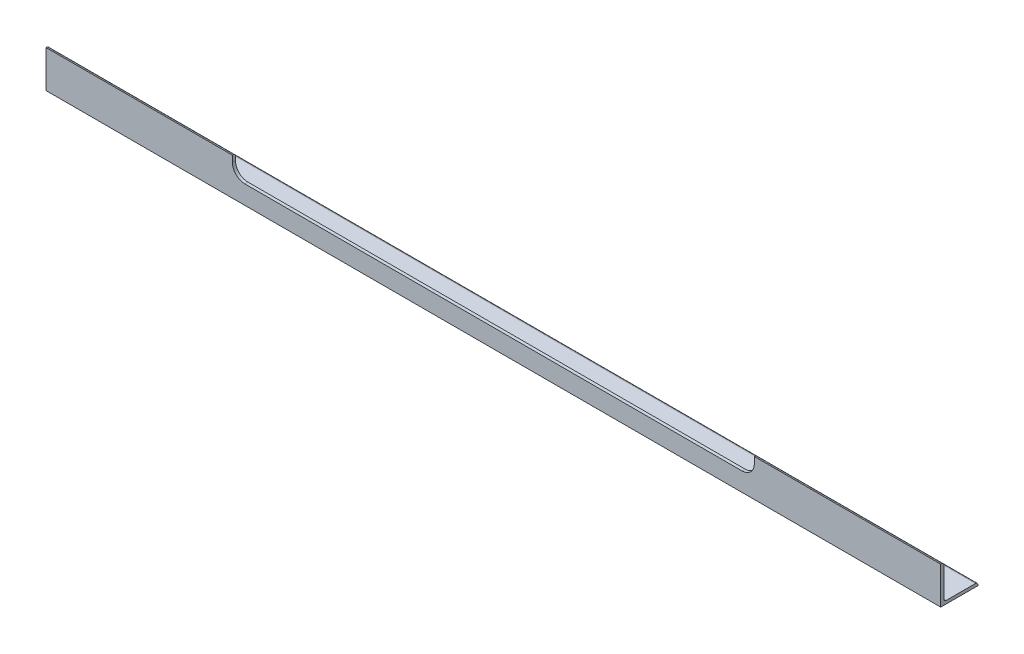
ISO-10303-21;
HEADER;
FILE_DESCRIPTION(('STEP AP214'),'2;1');
FILE_NAME('part.step','',(''),(''),'','','');
FILE_SCHEMA(('AUTOMOTIVE_DESIGN { 1 0 10303 214 1 1 1 1 }'));
ENDSEC;
DATA;
#1=APPLICATION_CONTEXT('core data for automotive mechanical design processes');
#2=APPLICATION_PROTOCOL_DEFINITION('international standard','automotive_design',2000,#1);
#3=PRODUCT_CONTEXT('',#1,'mechanical');
#4=PRODUCT('Part','Part','',(#3));
#5=PRODUCT_RELATED_PRODUCT_CATEGORY('part','',(#4));
#6=PRODUCT_DEFINITION_FORMATION('','',#4);
#7=PRODUCT_DEFINITION_CONTEXT('part definition',#1,'design');
#8=PRODUCT_DEFINITION('design','',#6,#7);
#9=PRODUCT_DEFINITION_SHAPE('','',#8);
#10=(LENGTH_UNIT() NAMED_UNIT(*) SI_UNIT(.MILLI.,.METRE.));
#11=(NAMED_UNIT(*) PLANE_ANGLE_UNIT() SI_UNIT($,.RADIAN.));
#12=(NAMED_UNIT(*) SI_UNIT($,.STERADIAN.) SOLID_ANGLE_UNIT());
#13=UNCERTAINTY_MEASURE_WITH_UNIT(LENGTH_MEASURE(1.E-05),#10,'distance_accuracy_value','');
#14=(GEOMETRIC_REPRESENTATION_CONTEXT(3) GLOBAL_UNCERTAINTY_ASSIGNED_CONTEXT((#13)) GLOBAL_UNIT_ASSIGNED_CONTEXT((#10,
#11,#12)) REPRESENTATION_CONTEXT('',''));
#15=CARTESIAN_POINT('',(0.,0.,0.));
#16=DIRECTION('',(0.,0.,1.));
#17=DIRECTION('',(1.,0.,0.));
#18=AXIS2_PLACEMENT_3D('',#15,#16,#17);
#19=CARTESIAN_POINT('',(-914.4,76.2,0.));
#20=DIRECTION('',(0.,1.,0.));
#21=DIRECTION('',(0.,0.,1.));
#22=AXIS2_PLACEMENT_3D('',#19,#20,#21);
#23=PLANE('',#22);
#24=DIRECTION('',(0.,0.,1.));
#25=VECTOR('',#24,1.);
#26=CARTESIAN_POINT('',(-533.4,76.2,-76.2));
#27=LINE('',#26,#25);
#28=CARTESIAN_POINT('',(-533.4,76.2,-1.27000000000002));
#29=VERTEX_POINT('',#28);
#30=CARTESIAN_POINT('',(-533.4,76.2,0.));
#31=VERTEX_POINT('',#30);
#32=EDGE_CURVE('E162',#29,#31,#27,.T.);
#33=ORIENTED_EDGE('',*,*,#32,.F.);
#34=DIRECTION('',(1.,0.,0.));
#35=VECTOR('',#34,1.);
#36=CARTESIAN_POINT('',(-914.4,76.2,-1.26999999999996));
#37=LINE('',#36,#35);
#38=CARTESIAN_POINT('',(-914.4,76.2,-1.26999999999996));
#39=VERTEX_POINT('',#38);
#40=EDGE_CURVE('E181',#39,#29,#37,.T.);
#41=ORIENTED_EDGE('',*,*,#40,.F.);
#42=DIRECTION('',(0.,0.,1.));
#43=VECTOR('',#42,1.);
#44=CARTESIAN_POINT('',(-914.4,76.2,0.));
#45=LINE('',#44,#43);
#46=CARTESIAN_POINT('',(-914.4,76.2,0.));
#47=VERTEX_POINT('',#46);
#48=EDGE_CURVE('E243',#39,#47,#45,.T.);
#49=ORIENTED_EDGE('',*,*,#48,.T.);
#50=DIRECTION('',(1.,0.,0.));
#51=VECTOR('',#50,1.);
#52=CARTESIAN_POINT('',(-914.4,76.2,0.));
#53=LINE('',#52,#51);
#54=EDGE_CURVE('E168',#47,#31,#53,.T.);
#55=ORIENTED_EDGE('',*,*,#54,.T.);
#56=EDGE_LOOP('',(#33,#41,#49,#55));
#57=FACE_BOUND('',#56,.T.);
#58=ADVANCED_FACE('F32',(#57),#23,.T.);
#59=CARTESIAN_POINT('',(-914.4,71.12,-1.27));
#60=DIRECTION('',(1.,0.,0.));
#61=DIRECTION('',(0.,0.,-1.));
#62=AXIS2_PLACEMENT_3D('',#59,#60,#61);
#63=CYLINDRICAL_SURFACE('',#62,5.08);
#64=CARTESIAN_POINT('',(-533.4,71.12,-1.27));
#65=DIRECTION('',(-1.,0.,0.));
#66=DIRECTION('',(0.,0.,1.));
#67=AXIS2_PLACEMENT_3D('',#64,#65,#66);
#68=CIRCLE('',#67,5.08);
#69=CARTESIAN_POINT('',(-533.4,71.12,-6.35));
#70=VERTEX_POINT('',#69);
#71=EDGE_CURVE('E217',#70,#29,#68,.F.);
#72=ORIENTED_EDGE('',*,*,#71,.F.);
#73=DIRECTION('',(1.,0.,0.));
#74=VECTOR('',#73,1.);
#75=CARTESIAN_POINT('',(-914.4,71.12,-6.35));
#76=LINE('',#75,#74);
#77=CARTESIAN_POINT('',(-914.4,71.12,-6.35));
#78=VERTEX_POINT('',#77);
#79=EDGE_CURVE('E268',#78,#70,#76,.T.);
#80=ORIENTED_EDGE('',*,*,#79,.F.);
#81=CARTESIAN_POINT('',(-914.4,71.12,-1.27));
#82=DIRECTION('',(1.,0.,0.));
#83=DIRECTION('',(0.,0.,-1.));
#84=AXIS2_PLACEMENT_3D('',#81,#82,#83);
#85=CIRCLE('',#84,5.08);
#86=EDGE_CURVE('E169',#78,#39,#85,.T.);
#87=ORIENTED_EDGE('',*,*,#86,.T.);
#88=ORIENTED_EDGE('',*,*,#40,.T.);
#89=EDGE_LOOP('',(#72,#80,#87,#88));
#90=FACE_BOUND('',#89,.T.);
#91=ADVANCED_FACE('F301',(#90),#63,.T.);
#92=DIRECTION('',(0.,0.,1.));
#93=VECTOR('',#92,1.);
#94=CARTESIAN_POINT('',(533.4,76.2,-76.2));
#95=LINE('',#94,#93);
#96=CARTESIAN_POINT('',(533.4,76.2,-1.27));
#97=VERTEX_POINT('',#96);
#98=CARTESIAN_POINT('',(533.4,76.2,0.));
#99=VERTEX_POINT('',#98);
#100=EDGE_CURVE('E148',#97,#99,#95,.T.);
#101=ORIENTED_EDGE('',*,*,#100,.T.);
#102=CARTESIAN_POINT('',(914.4,76.2,0.));
#103=VERTEX_POINT('',#102);
#104=EDGE_CURVE('E159',#99,#103,#53,.T.);
#105=ORIENTED_EDGE('',*,*,#104,.T.);
#106=DIRECTION('',(0.,0.,1.));
#107=VECTOR('',#106,1.);
#108=CARTESIAN_POINT('',(914.4,76.2,0.));
#109=LINE('',#108,#107);
#110=CARTESIAN_POINT('',(914.4,76.2,-1.26999999999996));
#111=VERTEX_POINT('',#110);
#112=EDGE_CURVE('E219',#111,#103,#109,.T.);
#113=ORIENTED_EDGE('',*,*,#112,.F.);
#114=EDGE_CURVE('E161',#97,#111,#37,.T.);
#115=ORIENTED_EDGE('',*,*,#114,.F.);
#116=EDGE_LOOP('',(#101,#105,#113,#115));
#117=FACE_BOUND('',#116,.T.);
#118=ADVANCED_FACE('F157',(#117),#23,.T.);
#119=CARTESIAN_POINT('',(533.4,71.12,-1.27));
#120=DIRECTION('',(1.,0.,0.));
#121=DIRECTION('',(0.,0.,-1.));
#122=AXIS2_PLACEMENT_3D('',#119,#120,#121);
#123=CIRCLE('',#122,5.08);
#124=CARTESIAN_POINT('',(533.4,71.12,-6.35));
#125=VERTEX_POINT('',#124);
#126=EDGE_CURVE('E201',#97,#125,#123,.F.);
#127=ORIENTED_EDGE('',*,*,#126,.F.);
#128=ORIENTED_EDGE('',*,*,#114,.T.);
#129=CARTESIAN_POINT('',(914.4,71.12,-1.27));
#130=DIRECTION('',(1.,0.,0.));
#131=DIRECTION('',(0.,0.,-1.));
#132=AXIS2_PLACEMENT_3D('',#129,#130,#131);
#133=CIRCLE('',#132,5.08);
#134=CARTESIAN_POINT('',(914.4,71.12,-6.35));
#135=VERTEX_POINT('',#134);
#136=EDGE_CURVE('E240',#135,#111,#133,.T.);
#137=ORIENTED_EDGE('',*,*,#136,.F.);
#138=EDGE_CURVE('E271',#125,#135,#76,.T.);
#139=ORIENTED_EDGE('',*,*,#138,.F.);
#140=EDGE_LOOP('',(#127,#128,#137,#139));
#141=FACE_BOUND('',#140,.T.);
#142=ADVANCED_FACE('F309',(#141),#63,.T.);
#143=CARTESIAN_POINT('',(-914.4,71.12,-6.35));
#144=DIRECTION('',(0.,0.,-1.));
#145=DIRECTION('',(-1.,0.,0.));
#146=AXIS2_PLACEMENT_3D('',#143,#144,#145);
#147=PLANE('',#146);
#148=DIRECTION('',(0.,1.,0.));
#149=VECTOR('',#148,1.);
#150=CARTESIAN_POINT('',(-533.4,71.12,-6.35));
#151=LINE('',#150,#149);
#152=CARTESIAN_POINT('',(-533.4,63.5,-6.35));
#153=VERTEX_POINT('',#152);
#154=EDGE_CURVE('E215',#153,#70,#151,.T.);
#155=ORIENTED_EDGE('',*,*,#154,.F.);
#156=CARTESIAN_POINT('',(-508.,63.5,-6.34999999999999));
#157=DIRECTION('',(0.,0.,-1.));
#158=DIRECTION('',(-1.,0.,0.));
#159=AXIS2_PLACEMENT_3D('',#156,#157,#158);
#160=CIRCLE('',#159,25.4);
#161=CARTESIAN_POINT('',(-508.,38.1,-6.35));
#162=VERTEX_POINT('',#161);
#163=EDGE_CURVE('E11',#153,#162,#160,.F.);
#164=ORIENTED_EDGE('',*,*,#163,.T.);
#165=DIRECTION('',(-1.,0.,0.));
#166=VECTOR('',#165,1.);
#167=CARTESIAN_POINT('',(-914.4,38.1,-6.35));
#168=LINE('',#167,#166);
#169=CARTESIAN_POINT('',(508.,38.1,-6.35));
#170=VERTEX_POINT('',#169);
#171=EDGE_CURVE('E198',#170,#162,#168,.T.);
#172=ORIENTED_EDGE('',*,*,#171,.F.);
#173=CARTESIAN_POINT('',(508.,63.5,-6.34999999999999));
#174=DIRECTION('',(0.,0.,-1.));
#175=DIRECTION('',(-1.,0.,0.));
#176=AXIS2_PLACEMENT_3D('',#173,#174,#175);
#177=CIRCLE('',#176,25.4);
#178=CARTESIAN_POINT('',(533.4,63.5,-6.35));
#179=VERTEX_POINT('',#178);
#180=EDGE_CURVE('E189',#170,#179,#177,.F.);
#181=ORIENTED_EDGE('',*,*,#180,.T.);
#182=DIRECTION('',(0.,-1.,0.));
#183=VECTOR('',#182,1.);
#184=CARTESIAN_POINT('',(533.4,71.12,-6.35));
#185=LINE('',#184,#183);
#186=EDGE_CURVE('E195',#125,#179,#185,.T.);
#187=ORIENTED_EDGE('',*,*,#186,.F.);
#188=ORIENTED_EDGE('',*,*,#138,.T.);
#189=DIRECTION('',(0.,1.,0.));
#190=VECTOR('',#189,1.);
#191=CARTESIAN_POINT('',(914.4,71.12,-6.35));
#192=LINE('',#191,#190);
#193=CARTESIAN_POINT('',(914.4,11.43,-6.35));
#194=VERTEX_POINT('',#193);
#195=EDGE_CURVE('E237',#194,#135,#192,.T.);
#196=ORIENTED_EDGE('',*,*,#195,.F.);
#197=DIRECTION('',(1.,0.,0.));
#198=VECTOR('',#197,1.);
#199=CARTESIAN_POINT('',(-914.4,11.43,-6.35));
#200=LINE('',#199,#198);
#201=CARTESIAN_POINT('',(-914.4,11.43,-6.35));
#202=VERTEX_POINT('',#201);
#203=EDGE_CURVE('E272',#202,#194,#200,.T.);
#204=ORIENTED_EDGE('',*,*,#203,.F.);
#205=DIRECTION('',(0.,1.,0.));
#206=VECTOR('',#205,1.);
#207=CARTESIAN_POINT('',(-914.4,71.12,-6.35));
#208=LINE('',#207,#206);
#209=EDGE_CURVE('E174',#202,#78,#208,.T.);
#210=ORIENTED_EDGE('',*,*,#209,.T.);
#211=ORIENTED_EDGE('',*,*,#79,.T.);
#212=EDGE_LOOP('',(#155,#164,#172,#181,#187,#188,#196,#204,#210,#211));
#213=FACE_BOUND('',#212,.T.);
#214=ADVANCED_FACE('F194',(#213),#147,.T.);
#215=CARTESIAN_POINT('',(-914.4,11.43,-11.43));
#216=DIRECTION('',(1.,0.,0.));
#217=DIRECTION('',(0.,0.,-1.));
#218=AXIS2_PLACEMENT_3D('',#215,#216,#217);
#219=CYLINDRICAL_SURFACE('',#218,5.08);
#220=ORIENTED_EDGE('',*,*,#203,.T.);
#221=CARTESIAN_POINT('',(914.4,11.43,-11.43));
#222=DIRECTION('',(-1.,0.,0.));
#223=DIRECTION('',(0.,0.,-1.));
#224=AXIS2_PLACEMENT_3D('',#221,#222,#223);
#225=CIRCLE('',#224,5.08);
#226=CARTESIAN_POINT('',(914.4,6.35,-11.43));
#227=VERTEX_POINT('',#226);
#228=EDGE_CURVE('E234',#227,#194,#225,.T.);
#229=ORIENTED_EDGE('',*,*,#228,.F.);
#230=DIRECTION('',(1.,0.,0.));
#231=VECTOR('',#230,1.);
#232=CARTESIAN_POINT('',(-914.4,6.35,-11.43));
#233=LINE('',#232,#231);
#234=CARTESIAN_POINT('',(-914.4,6.35,-11.43));
#235=VERTEX_POINT('',#234);
#236=EDGE_CURVE('E274',#235,#227,#233,.T.);
#237=ORIENTED_EDGE('',*,*,#236,.F.);
#238=CARTESIAN_POINT('',(-914.4,11.43,-11.43));
#239=DIRECTION('',(-1.,0.,0.));
#240=DIRECTION('',(0.,0.,-1.));
#241=AXIS2_PLACEMENT_3D('',#238,#239,#240);
#242=CIRCLE('',#241,5.08);
#243=EDGE_CURVE('E261',#235,#202,#242,.T.);
#244=ORIENTED_EDGE('',*,*,#243,.T.);
#245=EDGE_LOOP('',(#220,#229,#237,#244));
#246=FACE_BOUND('',#245,.T.);
#247=ADVANCED_FACE('F319',(#246),#219,.F.);
#248=CARTESIAN_POINT('',(-914.4,6.35,-11.43));
#249=DIRECTION('',(0.,1.,0.));
#250=DIRECTION('',(0.,0.,1.));
#251=AXIS2_PLACEMENT_3D('',#248,#249,#250);
#252=PLANE('',#251);
#253=ORIENTED_EDGE('',*,*,#236,.T.);
#254=DIRECTION('',(0.,0.,1.));
#255=VECTOR('',#254,1.);
#256=CARTESIAN_POINT('',(914.4,6.35,-11.43));
#257=LINE('',#256,#255);
#258=CARTESIAN_POINT('',(914.4,6.35,-71.12));
#259=VERTEX_POINT('',#258);
#260=EDGE_CURVE('E231',#259,#227,#257,.T.);
#261=ORIENTED_EDGE('',*,*,#260,.F.);
#262=DIRECTION('',(1.,0.,0.));
#263=VECTOR('',#262,1.);
#264=CARTESIAN_POINT('',(-914.4,6.35,-71.12));
#265=LINE('',#264,#263);
#266=CARTESIAN_POINT('',(-914.4,6.35,-71.12));
#267=VERTEX_POINT('',#266);
#268=EDGE_CURVE('E276',#267,#259,#265,.T.);
#269=ORIENTED_EDGE('',*,*,#268,.F.);
#270=DIRECTION('',(0.,0.,1.));
#271=VECTOR('',#270,1.);
#272=CARTESIAN_POINT('',(-914.4,6.35,-11.43));
#273=LINE('',#272,#271);
#274=EDGE_CURVE('E258',#267,#235,#273,.T.);
#275=ORIENTED_EDGE('',*,*,#274,.T.);
#276=EDGE_LOOP('',(#253,#261,#269,#275));
#277=FACE_BOUND('',#276,.T.);
#278=ADVANCED_FACE('F326',(#277),#252,.T.);
#279=CARTESIAN_POINT('',(-914.4,1.27,-71.12));
#280=DIRECTION('',(1.,0.,0.));
#281=DIRECTION('',(0.,0.,-1.));
#282=AXIS2_PLACEMENT_3D('',#279,#280,#281);
#283=CYLINDRICAL_SURFACE('',#282,5.08);
#284=ORIENTED_EDGE('',*,*,#268,.T.);
#285=CARTESIAN_POINT('',(914.4,1.27,-71.12));
#286=DIRECTION('',(1.,0.,0.));
#287=DIRECTION('',(0.,0.,1.));
#288=AXIS2_PLACEMENT_3D('',#285,#286,#287);
#289=CIRCLE('',#288,5.08);
#290=CARTESIAN_POINT('',(914.4,1.26999999999996,-76.2));
#291=VERTEX_POINT('',#290);
#292=EDGE_CURVE('E228',#291,#259,#289,.T.);
#293=ORIENTED_EDGE('',*,*,#292,.F.);
#294=DIRECTION('',(1.,0.,0.));
#295=VECTOR('',#294,1.);
#296=CARTESIAN_POINT('',(-914.4,1.26999999999996,-76.2));
#297=LINE('',#296,#295);
#298=CARTESIAN_POINT('',(-914.4,1.26999999999996,-76.2));
#299=VERTEX_POINT('',#298);
#300=EDGE_CURVE('E278',#299,#291,#297,.T.);
#301=ORIENTED_EDGE('',*,*,#300,.F.);
#302=CARTESIAN_POINT('',(-914.4,1.27,-71.12));
#303=DIRECTION('',(1.,0.,0.));
#304=DIRECTION('',(0.,0.,1.));
#305=AXIS2_PLACEMENT_3D('',#302,#303,#304);
#306=CIRCLE('',#305,5.08);
#307=EDGE_CURVE('E255',#299,#267,#306,.T.);
#308=ORIENTED_EDGE('',*,*,#307,.T.);
#309=EDGE_LOOP('',(#284,#293,#301,#308));
#310=FACE_BOUND('',#309,.T.);
#311=ADVANCED_FACE('F297',(#310),#283,.T.);
#312=CARTESIAN_POINT('',(-914.4,1.26999999999996,-76.2));
#313=DIRECTION('',(0.,0.,-1.));
#314=DIRECTION('',(-1.,0.,0.));
#315=AXIS2_PLACEMENT_3D('',#312,#313,#314);
#316=PLANE('',#315);
#317=ORIENTED_EDGE('',*,*,#300,.T.);
#318=DIRECTION('',(0.,1.,0.));
#319=VECTOR('',#318,1.);
#320=CARTESIAN_POINT('',(914.4,1.26999999999996,-76.2));
#321=LINE('',#320,#319);
#322=CARTESIAN_POINT('',(914.4,0.,-76.2));
#323=VERTEX_POINT('',#322);
#324=EDGE_CURVE('E225',#323,#291,#321,.T.);
#325=ORIENTED_EDGE('',*,*,#324,.F.);
#326=DIRECTION('',(1.,0.,0.));
#327=VECTOR('',#326,1.);
#328=CARTESIAN_POINT('',(-914.4,0.,-76.2));
#329=LINE('',#328,#327);
#330=CARTESIAN_POINT('',(-914.4,0.,-76.2));
#331=VERTEX_POINT('',#330);
#332=EDGE_CURVE('E279',#331,#323,#329,.T.);
#333=ORIENTED_EDGE('',*,*,#332,.F.);
#334=DIRECTION('',(0.,1.,0.));
#335=VECTOR('',#334,1.);
#336=CARTESIAN_POINT('',(-914.4,1.26999999999996,-76.2));
#337=LINE('',#336,#335);
#338=EDGE_CURVE('E252',#331,#299,#337,.T.);
#339=ORIENTED_EDGE('',*,*,#338,.T.);
#340=EDGE_LOOP('',(#317,#325,#333,#339));
#341=FACE_BOUND('',#340,.T.);
#342=ADVANCED_FACE('F289',(#341),#316,.T.);
#343=CARTESIAN_POINT('',(-914.4,0.,0.));
#344=DIRECTION('',(0.,-1.,0.));
#345=DIRECTION('',(0.,0.,-1.));
#346=AXIS2_PLACEMENT_3D('',#343,#344,#345);
#347=PLANE('',#346);
#348=ORIENTED_EDGE('',*,*,#332,.T.);
#349=DIRECTION('',(0.,0.,-1.));
#350=VECTOR('',#349,1.);
#351=CARTESIAN_POINT('',(914.4,0.,0.));
#352=LINE('',#351,#350);
#353=CARTESIAN_POINT('',(914.4,0.,0.));
#354=VERTEX_POINT('',#353);
#355=EDGE_CURVE('E222',#354,#323,#352,.T.);
#356=ORIENTED_EDGE('',*,*,#355,.F.);
#357=DIRECTION('',(1.,0.,0.));
#358=VECTOR('',#357,1.);
#359=CARTESIAN_POINT('',(-914.4,0.,0.));
#360=LINE('',#359,#358);
#361=CARTESIAN_POINT('',(-914.4,0.,0.));
#362=VERTEX_POINT('',#361);
#363=EDGE_CURVE('E172',#362,#354,#360,.T.);
#364=ORIENTED_EDGE('',*,*,#363,.F.);
#365=DIRECTION('',(0.,0.,-1.));
#366=VECTOR('',#365,1.);
#367=CARTESIAN_POINT('',(-914.4,0.,0.));
#368=LINE('',#367,#366);
#369=EDGE_CURVE('E249',#362,#331,#368,.T.);
#370=ORIENTED_EDGE('',*,*,#369,.T.);
#371=EDGE_LOOP('',(#348,#356,#364,#370));
#372=FACE_BOUND('',#371,.T.);
#373=ADVANCED_FACE('F287',(#372),#347,.T.);
#374=CARTESIAN_POINT('',(-914.4,76.2,0.));
#375=DIRECTION('',(0.,0.,1.));
#376=DIRECTION('',(1.,0.,0.));
#377=AXIS2_PLACEMENT_3D('',#374,#375,#376);
#378=PLANE('',#377);
#379=DIRECTION('',(0.,-1.,0.));
#380=VECTOR('',#379,1.);
#381=CARTESIAN_POINT('',(-533.4,76.2,0.));
#382=LINE('',#381,#380);
#383=CARTESIAN_POINT('',(-533.4,63.5,0.));
#384=VERTEX_POINT('',#383);
#385=EDGE_CURVE('E208',#31,#384,#382,.T.);
#386=ORIENTED_EDGE('',*,*,#385,.F.);
#387=ORIENTED_EDGE('',*,*,#54,.F.);
#388=DIRECTION('',(0.,-1.,0.));
#389=VECTOR('',#388,1.);
#390=CARTESIAN_POINT('',(-914.4,76.2,0.));
#391=LINE('',#390,#389);
#392=EDGE_CURVE('E246',#47,#362,#391,.T.);
#393=ORIENTED_EDGE('',*,*,#392,.T.);
#394=ORIENTED_EDGE('',*,*,#363,.T.);
#395=DIRECTION('',(0.,-1.,0.));
#396=VECTOR('',#395,1.);
#397=CARTESIAN_POINT('',(914.4,76.2,0.));
#398=LINE('',#397,#396);
#399=EDGE_CURVE('E166',#103,#354,#398,.T.);
#400=ORIENTED_EDGE('',*,*,#399,.F.);
#401=ORIENTED_EDGE('',*,*,#104,.F.);
#402=DIRECTION('',(0.,1.,0.));
#403=VECTOR('',#402,1.);
#404=CARTESIAN_POINT('',(533.4,76.2,0.));
#405=LINE('',#404,#403);
#406=CARTESIAN_POINT('',(533.4,63.5,0.));
#407=VERTEX_POINT('',#406);
#408=EDGE_CURVE('E144',#407,#99,#405,.T.);
#409=ORIENTED_EDGE('',*,*,#408,.F.);
#410=CARTESIAN_POINT('',(508.,63.5,0.));
#411=DIRECTION('',(0.,0.,1.));
#412=DIRECTION('',(1.,0.,0.));
#413=AXIS2_PLACEMENT_3D('',#410,#411,#412);
#414=CIRCLE('',#413,25.4);
#415=CARTESIAN_POINT('',(508.,38.1,0.));
#416=VERTEX_POINT('',#415);
#417=EDGE_CURVE('E187',#407,#416,#414,.F.);
#418=ORIENTED_EDGE('',*,*,#417,.T.);
#419=DIRECTION('',(1.,0.,0.));
#420=VECTOR('',#419,1.);
#421=CARTESIAN_POINT('',(-533.4,38.1,0.));
#422=LINE('',#421,#420);
#423=CARTESIAN_POINT('',(-508.,38.1,0.));
#424=VERTEX_POINT('',#423);
#425=EDGE_CURVE('E153',#424,#416,#422,.T.);
#426=ORIENTED_EDGE('',*,*,#425,.F.);
#427=CARTESIAN_POINT('',(-508.,63.5,0.));
#428=DIRECTION('',(0.,0.,1.));
#429=DIRECTION('',(1.,0.,0.));
#430=AXIS2_PLACEMENT_3D('',#427,#428,#429);
#431=CIRCLE('',#430,25.4);
#432=EDGE_CURVE('E40',#424,#384,#431,.F.);
#433=ORIENTED_EDGE('',*,*,#432,.T.);
#434=EDGE_LOOP('',(#386,#387,#393,#394,#400,#401,#409,#418,#426,#433));
#435=FACE_BOUND('',#434,.T.);
#436=ADVANCED_FACE('F164',(#435),#378,.T.);
#437=CARTESIAN_POINT('',(-914.4,71.12,-1.27));
#438=DIRECTION('',(1.,0.,0.));
#439=DIRECTION('',(0.,0.,-1.));
#440=AXIS2_PLACEMENT_3D('',#437,#438,#439);
#441=PLANE('',#440);
#442=ORIENTED_EDGE('',*,*,#48,.F.);
#443=ORIENTED_EDGE('',*,*,#86,.F.);
#444=ORIENTED_EDGE('',*,*,#209,.F.);
#445=ORIENTED_EDGE('',*,*,#243,.F.);
#446=ORIENTED_EDGE('',*,*,#274,.F.);
#447=ORIENTED_EDGE('',*,*,#307,.F.);
#448=ORIENTED_EDGE('',*,*,#338,.F.);
#449=ORIENTED_EDGE('',*,*,#369,.F.);
#450=ORIENTED_EDGE('',*,*,#392,.F.);
#451=EDGE_LOOP('',(#442,#443,#444,#445,#446,#447,#448,#449,#450));
#452=FACE_BOUND('',#451,.T.);
#453=ADVANCED_FACE('F295',(#452),#441,.F.);
#454=CARTESIAN_POINT('',(914.4,71.12,-1.27));
#455=DIRECTION('',(1.,0.,0.));
#456=DIRECTION('',(0.,0.,-1.));
#457=AXIS2_PLACEMENT_3D('',#454,#455,#456);
#458=PLANE('',#457);
#459=ORIENTED_EDGE('',*,*,#112,.T.);
#460=ORIENTED_EDGE('',*,*,#399,.T.);
#461=ORIENTED_EDGE('',*,*,#355,.T.);
#462=ORIENTED_EDGE('',*,*,#324,.T.);
#463=ORIENTED_EDGE('',*,*,#292,.T.);
#464=ORIENTED_EDGE('',*,*,#260,.T.);
#465=ORIENTED_EDGE('',*,*,#228,.T.);
#466=ORIENTED_EDGE('',*,*,#195,.T.);
#467=ORIENTED_EDGE('',*,*,#136,.T.);
#468=EDGE_LOOP('',(#459,#460,#461,#462,#463,#464,#465,#466,#467));
#469=FACE_BOUND('',#468,.T.);
#470=ADVANCED_FACE('F285',(#469),#458,.T.);
#471=CARTESIAN_POINT('',(-533.4,76.2,-76.2));
#472=DIRECTION('',(-1.,0.,0.));
#473=DIRECTION('',(0.,0.,1.));
#474=AXIS2_PLACEMENT_3D('',#471,#472,#473);
#475=PLANE('',#474);
#476=ORIENTED_EDGE('',*,*,#385,.T.);
#477=DIRECTION('',(0.,0.,1.));
#478=VECTOR('',#477,1.);
#479=CARTESIAN_POINT('',(-533.4,63.5,-6.35000000000002));
#480=LINE('',#479,#478);
#481=EDGE_CURVE('E47',#384,#153,#480,.F.);
#482=ORIENTED_EDGE('',*,*,#481,.T.);
#483=ORIENTED_EDGE('',*,*,#154,.T.);
#484=ORIENTED_EDGE('',*,*,#71,.T.);
#485=ORIENTED_EDGE('',*,*,#32,.T.);
#486=EDGE_LOOP('',(#476,#482,#483,#484,#485));
#487=FACE_BOUND('',#486,.T.);
#488=ADVANCED_FACE('F349',(#487),#475,.F.);
#489=CARTESIAN_POINT('',(533.4,76.2,-76.2));
#490=DIRECTION('',(1.,0.,0.));
#491=DIRECTION('',(0.,0.,-1.));
#492=AXIS2_PLACEMENT_3D('',#489,#490,#491);
#493=PLANE('',#492);
#494=ORIENTED_EDGE('',*,*,#186,.T.);
#495=DIRECTION('',(0.,0.,1.));
#496=VECTOR('',#495,1.);
#497=CARTESIAN_POINT('',(533.4,63.5,0.));
#498=LINE('',#497,#496);
#499=EDGE_CURVE('E151',#179,#407,#498,.T.);
#500=ORIENTED_EDGE('',*,*,#499,.T.);
#501=ORIENTED_EDGE('',*,*,#408,.T.);
#502=ORIENTED_EDGE('',*,*,#100,.F.);
#503=ORIENTED_EDGE('',*,*,#126,.T.);
#504=EDGE_LOOP('',(#494,#500,#501,#502,#503));
#505=FACE_BOUND('',#504,.T.);
#506=ADVANCED_FACE('F147',(#505),#493,.F.);
#507=CARTESIAN_POINT('',(-533.4,38.1,-76.2));
#508=DIRECTION('',(0.,-1.,0.));
#509=DIRECTION('',(0.,0.,-1.));
#510=AXIS2_PLACEMENT_3D('',#507,#508,#509);
#511=PLANE('',#510);
#512=ORIENTED_EDGE('',*,*,#425,.T.);
#513=DIRECTION('',(0.,0.,1.));
#514=VECTOR('',#513,1.);
#515=CARTESIAN_POINT('',(508.,38.1,-6.35000000000002));
#516=LINE('',#515,#514);
#517=EDGE_CURVE('E184',#416,#170,#516,.F.);
#518=ORIENTED_EDGE('',*,*,#517,.T.);
#519=ORIENTED_EDGE('',*,*,#171,.T.);
#520=DIRECTION('',(0.,0.,1.));
#521=VECTOR('',#520,1.);
#522=CARTESIAN_POINT('',(-508.,38.1,0.));
#523=LINE('',#522,#521);
#524=EDGE_CURVE('E180',#162,#424,#523,.T.);
#525=ORIENTED_EDGE('',*,*,#524,.T.);
#526=EDGE_LOOP('',(#512,#518,#519,#525));
#527=FACE_BOUND('',#526,.T.);
#528=ADVANCED_FACE('F206',(#527),#511,.F.);
#529=CARTESIAN_POINT('',(508.,63.5,-76.2));
#530=DIRECTION('',(0.,0.,-1.));
#531=DIRECTION('',(-1.,0.,0.));
#532=AXIS2_PLACEMENT_3D('',#529,#530,#531);
#533=CYLINDRICAL_SURFACE('',#532,25.4);
#534=ORIENTED_EDGE('',*,*,#180,.F.);
#535=ORIENTED_EDGE('',*,*,#517,.F.);
#536=ORIENTED_EDGE('',*,*,#417,.F.);
#537=ORIENTED_EDGE('',*,*,#499,.F.);
#538=EDGE_LOOP('',(#534,#535,#536,#537));
#539=FACE_BOUND('',#538,.T.);
#540=ADVANCED_FACE('F203',(#539),#533,.F.);
#541=CARTESIAN_POINT('',(-508.,63.5,-76.2));
#542=DIRECTION('',(0.,0.,-1.));
#543=DIRECTION('',(-1.,0.,0.));
#544=AXIS2_PLACEMENT_3D('',#541,#542,#543);
#545=CYLINDRICAL_SURFACE('',#544,25.4);
#546=ORIENTED_EDGE('',*,*,#163,.F.);
#547=ORIENTED_EDGE('',*,*,#481,.F.);
#548=ORIENTED_EDGE('',*,*,#432,.F.);
#549=ORIENTED_EDGE('',*,*,#524,.F.);
#550=EDGE_LOOP('',(#546,#547,#548,#549));
#551=FACE_BOUND('',#550,.T.);
#552=ADVANCED_FACE('F34',(#551),#545,.F.);
#553=CLOSED_SHELL('',(#58,#91,#118,#142,#214,#247,#278,#311,#342,#373,#436,#453,#470,#488,#506,
#528,#540,#552));
#554=MANIFOLD_SOLID_BREP('B2',#553);
#555=ADVANCED_BREP_SHAPE_REPRESENTATION('',(#18,#554),#14);
#556=SHAPE_DEFINITION_REPRESENTATION(#9,#555);
ENDSEC;
END-ISO-10303-21;
